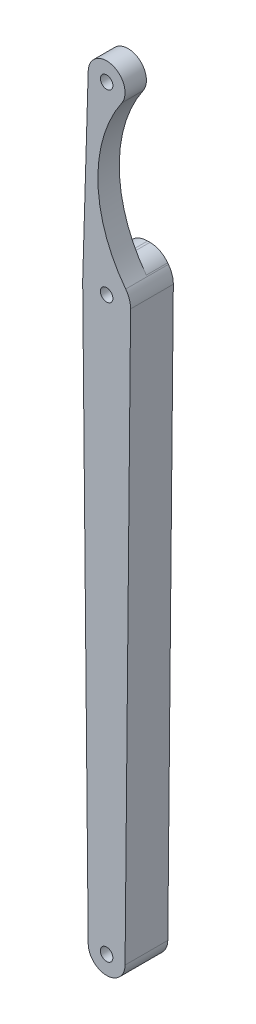
ISO-10303-21;
HEADER;
FILE_DESCRIPTION(('STEP AP214'),'2;1');
FILE_NAME('part.step','',(''),(''),'','','');
FILE_SCHEMA(('AUTOMOTIVE_DESIGN { 1 0 10303 214 1 1 1 1 }'));
ENDSEC;
DATA;
#1=APPLICATION_CONTEXT('core data for automotive mechanical design processes');
#2=APPLICATION_PROTOCOL_DEFINITION('international standard','automotive_design',2000,#1);
#3=PRODUCT_CONTEXT('',#1,'mechanical');
#4=PRODUCT('Part','Part','',(#3));
#5=PRODUCT_RELATED_PRODUCT_CATEGORY('part','',(#4));
#6=PRODUCT_DEFINITION_FORMATION('','',#4);
#7=PRODUCT_DEFINITION_CONTEXT('part definition',#1,'design');
#8=PRODUCT_DEFINITION('design','',#6,#7);
#9=PRODUCT_DEFINITION_SHAPE('','',#8);
#10=(LENGTH_UNIT() NAMED_UNIT(*) SI_UNIT(.MILLI.,.METRE.));
#11=(NAMED_UNIT(*) PLANE_ANGLE_UNIT() SI_UNIT($,.RADIAN.));
#12=(NAMED_UNIT(*) SI_UNIT($,.STERADIAN.) SOLID_ANGLE_UNIT());
#13=UNCERTAINTY_MEASURE_WITH_UNIT(LENGTH_MEASURE(1.E-05),#10,'distance_accuracy_value','');
#14=(GEOMETRIC_REPRESENTATION_CONTEXT(3) GLOBAL_UNCERTAINTY_ASSIGNED_CONTEXT((#13)) GLOBAL_UNIT_ASSIGNED_CONTEXT((#10,
#11,#12)) REPRESENTATION_CONTEXT('',''));
#15=CARTESIAN_POINT('',(0.,0.,0.));
#16=DIRECTION('',(0.,0.,1.));
#17=DIRECTION('',(1.,0.,0.));
#18=AXIS2_PLACEMENT_3D('',#15,#16,#17);
#19=CARTESIAN_POINT('',(-174.662698807646,24.,5.8));
#20=DIRECTION('',(0.,0.,1.));
#21=DIRECTION('',(1.,0.,0.));
#22=AXIS2_PLACEMENT_3D('',#19,#20,#21);
#23=PLANE('',#22);
#24=CARTESIAN_POINT('',(-174.662698807646,-131.,5.8));
#25=DIRECTION('',(0.,0.,1.));
#26=DIRECTION('',(1.,0.,0.));
#27=AXIS2_PLACEMENT_3D('',#24,#25,#26);
#28=CIRCLE('',#27,1.70000000000001);
#29=CARTESIAN_POINT('',(-172.962698807646,-131.,5.8));
#30=VERTEX_POINT('',#29);
#31=EDGE_CURVE('E239',#30,#30,#28,.T.);
#32=ORIENTED_EDGE('',*,*,#31,.F.);
#33=EDGE_LOOP('',(#32));
#34=FACE_BOUND('',#33,.T.);
#35=CARTESIAN_POINT('',(-174.662698807646,24.,5.8));
#36=DIRECTION('',(0.,0.,1.));
#37=DIRECTION('',(1.,0.,0.));
#38=AXIS2_PLACEMENT_3D('',#35,#36,#37);
#39=CIRCLE('',#38,6.49999999999999);
#40=CARTESIAN_POINT('',(-181.159773149225,24.195,5.8));
#41=VERTEX_POINT('',#40);
#42=CARTESIAN_POINT('',(-181.162394430072,23.9370967741936,5.8));
#43=VERTEX_POINT('',#42);
#44=EDGE_CURVE('E208',#41,#43,#39,.T.);
#45=ORIENTED_EDGE('',*,*,#44,.T.);
#46=DIRECTION('',(0.00967741935483877,-0.999953172680916,0.));
#47=VECTOR('',#46,1.);
#48=CARTESIAN_POINT('',(-181.162394430072,23.9370967741936,5.8));
#49=LINE('',#48,#47);
#50=CARTESIAN_POINT('',(-179.662464671051,-131.048387096774,5.8));
#51=VERTEX_POINT('',#50);
#52=EDGE_CURVE('E232',#43,#51,#49,.T.);
#53=ORIENTED_EDGE('',*,*,#52,.T.);
#54=CARTESIAN_POINT('',(-174.662698807646,-131.,5.8));
#55=DIRECTION('',(0.,0.,1.));
#56=DIRECTION('',(1.,0.,0.));
#57=AXIS2_PLACEMENT_3D('',#54,#55,#56);
#58=CIRCLE('',#57,5.00000000000001);
#59=CARTESIAN_POINT('',(-169.662932944241,-131.048387096774,5.8));
#60=VERTEX_POINT('',#59);
#61=EDGE_CURVE('E230',#51,#60,#58,.T.);
#62=ORIENTED_EDGE('',*,*,#61,.T.);
#63=DIRECTION('',(0.00967741935483877,0.999953172680916,0.));
#64=VECTOR('',#63,1.);
#65=CARTESIAN_POINT('',(-169.662932944241,-131.048387096774,5.8));
#66=LINE('',#65,#64);
#67=CARTESIAN_POINT('',(-168.16300318522,23.9370967741936,5.8));
#68=VERTEX_POINT('',#67);
#69=EDGE_CURVE('E228',#60,#68,#66,.T.);
#70=ORIENTED_EDGE('',*,*,#69,.T.);
#71=CARTESIAN_POINT('',(-174.662698807646,24.,5.8));
#72=DIRECTION('',(0.,0.,1.));
#73=DIRECTION('',(1.,0.,0.));
#74=AXIS2_PLACEMENT_3D('',#71,#72,#73);
#75=CIRCLE('',#74,6.50000000000002);
#76=CARTESIAN_POINT('',(-169.493465210308,27.9406882668078,5.8));
#77=VERTEX_POINT('',#76);
#78=EDGE_CURVE('E226',#68,#77,#75,.T.);
#79=ORIENTED_EDGE('',*,*,#78,.T.);
#80=CARTESIAN_POINT('',(-140.192523240276,50.277825107981,5.8));
#81=DIRECTION('',(0.,0.,-1.));
#82=DIRECTION('',(-1.,0.,0.));
#83=AXIS2_PLACEMENT_3D('',#80,#81,#82);
#84=CIRCLE('',#83,36.844170266034);
#85=CARTESIAN_POINT('',(-170.543824499921,71.1654145916624,5.8));
#86=VERTEX_POINT('',#85);
#87=EDGE_CURVE('E224',#77,#86,#84,.T.);
#88=ORIENTED_EDGE('',*,*,#87,.T.);
#89=CARTESIAN_POINT('',(-174.662698807646,74.,5.8));
#90=DIRECTION('',(0.,0.,1.));
#91=DIRECTION('',(1.,0.,0.));
#92=AXIS2_PLACEMENT_3D('',#89,#90,#91);
#93=CIRCLE('',#92,4.99999999999997);
#94=CARTESIAN_POINT('',(-179.660448301168,74.15,5.8));
#95=VERTEX_POINT('',#94);
#96=EDGE_CURVE('E222',#86,#95,#93,.T.);
#97=ORIENTED_EDGE('',*,*,#96,.T.);
#98=DIRECTION('',(-0.0300000000000006,-0.999549898704412,0.));
#99=VECTOR('',#98,1.);
#100=CARTESIAN_POINT('',(-181.159773149225,24.195,5.8));
#101=LINE('',#100,#99);
#102=EDGE_CURVE('E144',#95,#41,#101,.T.);
#103=ORIENTED_EDGE('',*,*,#102,.T.);
#104=EDGE_LOOP('',(#45,#53,#62,#70,#79,#88,#97,#103));
#105=FACE_BOUND('',#104,.T.);
#106=CARTESIAN_POINT('',(-174.662698807646,24.,5.8));
#107=DIRECTION('',(0.,0.,1.));
#108=DIRECTION('',(1.,0.,0.));
#109=AXIS2_PLACEMENT_3D('',#106,#107,#108);
#110=CIRCLE('',#109,1.70000000000001);
#111=CARTESIAN_POINT('',(-172.962698807646,24.,5.8));
#112=VERTEX_POINT('',#111);
#113=EDGE_CURVE('E220',#112,#112,#110,.T.);
#114=ORIENTED_EDGE('',*,*,#113,.F.);
#115=EDGE_LOOP('',(#114));
#116=FACE_BOUND('',#115,.T.);
#117=CARTESIAN_POINT('',(-174.662698807646,74.,5.8));
#118=DIRECTION('',(0.,0.,1.));
#119=DIRECTION('',(1.,0.,0.));
#120=AXIS2_PLACEMENT_3D('',#117,#118,#119);
#121=CIRCLE('',#120,1.70000000000001);
#122=CARTESIAN_POINT('',(-172.962698807646,74.,5.8));
#123=VERTEX_POINT('',#122);
#124=EDGE_CURVE('E245',#123,#123,#121,.T.);
#125=ORIENTED_EDGE('',*,*,#124,.F.);
#126=EDGE_LOOP('',(#125));
#127=FACE_BOUND('',#126,.T.);
#128=ADVANCED_FACE('F36',(#34,#105,#116,#127),#23,.T.);
#129=CARTESIAN_POINT('',(-174.662698807646,24.,-5.8));
#130=DIRECTION('',(0.,0.,1.));
#131=DIRECTION('',(1.,0.,0.));
#132=AXIS2_PLACEMENT_3D('',#129,#130,#131);
#133=PLANE('',#132);
#134=CARTESIAN_POINT('',(-174.662698807646,-131.,-5.8));
#135=DIRECTION('',(0.,0.,1.));
#136=DIRECTION('',(1.,0.,0.));
#137=AXIS2_PLACEMENT_3D('',#134,#135,#136);
#138=CIRCLE('',#137,1.70000000000001);
#139=CARTESIAN_POINT('',(-172.962698807646,-131.,-5.8));
#140=VERTEX_POINT('',#139);
#141=EDGE_CURVE('E242',#140,#140,#138,.T.);
#142=ORIENTED_EDGE('',*,*,#141,.T.);
#143=EDGE_LOOP('',(#142));
#144=FACE_BOUND('',#143,.T.);
#145=DIRECTION('',(1.,0.,0.));
#146=VECTOR('',#145,1.);
#147=CARTESIAN_POINT('',(-279.6,30.6124512493652,-5.8));
#148=LINE('',#147,#146);
#149=CARTESIAN_POINT('',(-175.144542148477,30.6124512493652,-5.8));
#150=VERTEX_POINT('',#149);
#151=CARTESIAN_POINT('',(-174.498667157691,30.6124512493652,-5.8));
#152=VERTEX_POINT('',#151);
#153=EDGE_CURVE('E170',#150,#152,#148,.T.);
#154=ORIENTED_EDGE('',*,*,#153,.T.);
#155=CARTESIAN_POINT('',(-174.498667157691,24.6124512493652,-5.8));
#156=DIRECTION('',(0.,0.,1.));
#157=DIRECTION('',(1.,0.,0.));
#158=AXIS2_PLACEMENT_3D('',#155,#156,#157);
#159=CIRCLE('',#158,6.);
#160=CARTESIAN_POINT('',(-169.694352773111,28.2066915437974,-5.8));
#161=VERTEX_POINT('',#160);
#162=EDGE_CURVE('E178',#152,#161,#159,.F.);
#163=ORIENTED_EDGE('',*,*,#162,.T.);
#164=CARTESIAN_POINT('',(-140.192523240276,50.277825107981,-5.8));
#165=DIRECTION('',(0.,0.,-1.));
#166=DIRECTION('',(-1.,0.,0.));
#167=AXIS2_PLACEMENT_3D('',#164,#165,#166);
#168=CIRCLE('',#167,36.844170266034);
#169=CARTESIAN_POINT('',(-169.493465210308,27.9406882668078,-5.8));
#170=VERTEX_POINT('',#169);
#171=EDGE_CURVE('E200',#170,#161,#168,.T.);
#172=ORIENTED_EDGE('',*,*,#171,.F.);
#173=CARTESIAN_POINT('',(-174.662698807646,24.,-5.8));
#174=DIRECTION('',(0.,0.,1.));
#175=DIRECTION('',(1.,0.,0.));
#176=AXIS2_PLACEMENT_3D('',#173,#174,#175);
#177=CIRCLE('',#176,6.50000000000002);
#178=CARTESIAN_POINT('',(-168.16300318522,23.9370967741936,-5.8));
#179=VERTEX_POINT('',#178);
#180=EDGE_CURVE('E206',#179,#170,#177,.T.);
#181=ORIENTED_EDGE('',*,*,#180,.F.);
#182=DIRECTION('',(0.00967741935483877,0.999953172680916,0.));
#183=VECTOR('',#182,1.);
#184=CARTESIAN_POINT('',(-169.662932944241,-131.048387096774,-5.8));
#185=LINE('',#184,#183);
#186=CARTESIAN_POINT('',(-169.662932944241,-131.048387096774,-5.8));
#187=VERTEX_POINT('',#186);
#188=EDGE_CURVE('E209',#187,#179,#185,.T.);
#189=ORIENTED_EDGE('',*,*,#188,.F.);
#190=CARTESIAN_POINT('',(-174.662698807646,-131.,-5.8));
#191=DIRECTION('',(0.,0.,1.));
#192=DIRECTION('',(1.,0.,0.));
#193=AXIS2_PLACEMENT_3D('',#190,#191,#192);
#194=CIRCLE('',#193,5.00000000000001);
#195=CARTESIAN_POINT('',(-179.662464671051,-131.048387096774,-5.8));
#196=VERTEX_POINT('',#195);
#197=EDGE_CURVE('E213',#196,#187,#194,.T.);
#198=ORIENTED_EDGE('',*,*,#197,.F.);
#199=DIRECTION('',(0.00967741935483877,-0.999953172680916,0.));
#200=VECTOR('',#199,1.);
#201=CARTESIAN_POINT('',(-181.162394430072,23.9370967741936,-5.8));
#202=LINE('',#201,#200);
#203=CARTESIAN_POINT('',(-181.162394430072,23.9370967741936,-5.8));
#204=VERTEX_POINT('',#203);
#205=EDGE_CURVE('E215',#204,#196,#202,.T.);
#206=ORIENTED_EDGE('',*,*,#205,.F.);
#207=CARTESIAN_POINT('',(-174.662698807646,24.,-5.8));
#208=DIRECTION('',(0.,0.,1.));
#209=DIRECTION('',(1.,0.,0.));
#210=AXIS2_PLACEMENT_3D('',#207,#208,#209);
#211=CIRCLE('',#210,6.49999999999999);
#212=CARTESIAN_POINT('',(-181.159773149225,24.195,-5.8));
#213=VERTEX_POINT('',#212);
#214=EDGE_CURVE('E217',#213,#204,#211,.T.);
#215=ORIENTED_EDGE('',*,*,#214,.F.);
#216=DIRECTION('',(-0.0300000000000006,-0.999549898704412,0.));
#217=VECTOR('',#216,1.);
#218=CARTESIAN_POINT('',(-181.159773149225,24.195,-5.8));
#219=LINE('',#218,#217);
#220=CARTESIAN_POINT('',(-181.141841540703,24.7924512493652,-5.8));
#221=VERTEX_POINT('',#220);
#222=EDGE_CURVE('E205',#221,#213,#219,.T.);
#223=ORIENTED_EDGE('',*,*,#222,.F.);
#224=CARTESIAN_POINT('',(-175.144542148477,24.6124512493652,-5.8));
#225=DIRECTION('',(0.,0.,1.));
#226=DIRECTION('',(1.,0.,0.));
#227=AXIS2_PLACEMENT_3D('',#224,#225,#226);
#228=CIRCLE('',#227,6.);
#229=EDGE_CURVE('E58',#221,#150,#228,.F.);
#230=ORIENTED_EDGE('',*,*,#229,.T.);
#231=EDGE_LOOP('',(#154,#163,#172,#181,#189,#198,#206,#215,#223,#230));
#232=FACE_BOUND('',#231,.T.);
#233=CARTESIAN_POINT('',(-174.662698807646,24.,-5.8));
#234=DIRECTION('',(0.,0.,1.));
#235=DIRECTION('',(1.,0.,0.));
#236=AXIS2_PLACEMENT_3D('',#233,#234,#235);
#237=CIRCLE('',#236,1.70000000000001);
#238=CARTESIAN_POINT('',(-172.962698807646,24.,-5.8));
#239=VERTEX_POINT('',#238);
#240=EDGE_CURVE('E236',#239,#239,#237,.T.);
#241=ORIENTED_EDGE('',*,*,#240,.T.);
#242=EDGE_LOOP('',(#241));
#243=FACE_BOUND('',#242,.T.);
#244=ADVANCED_FACE('F197',(#144,#232,#243),#133,.F.);
#245=CARTESIAN_POINT('',(-174.662698807646,24.,5.8));
#246=DIRECTION('',(0.,0.,-1.));
#247=DIRECTION('',(-1.,0.,0.));
#248=AXIS2_PLACEMENT_3D('',#245,#246,#247);
#249=CYLINDRICAL_SURFACE('',#248,6.49999999999999);
#250=ORIENTED_EDGE('',*,*,#214,.T.);
#251=DIRECTION('',(0.,0.,-1.));
#252=VECTOR('',#251,1.);
#253=CARTESIAN_POINT('',(-181.162394430072,23.9370967741936,5.8));
#254=LINE('',#253,#252);
#255=EDGE_CURVE('E164',#43,#204,#254,.T.);
#256=ORIENTED_EDGE('',*,*,#255,.F.);
#257=ORIENTED_EDGE('',*,*,#44,.F.);
#258=DIRECTION('',(0.,0.,-1.));
#259=VECTOR('',#258,1.);
#260=CARTESIAN_POINT('',(-181.159773149225,24.195,5.8));
#261=LINE('',#260,#259);
#262=EDGE_CURVE('E145',#41,#213,#261,.T.);
#263=ORIENTED_EDGE('',*,*,#262,.T.);
#264=EDGE_LOOP('',(#250,#256,#257,#263));
#265=FACE_BOUND('',#264,.T.);
#266=ADVANCED_FACE('F273',(#265),#249,.T.);
#267=CARTESIAN_POINT('',(-181.162394430072,23.9370967741936,5.8));
#268=DIRECTION('',(0.999953172680916,0.00967741935483877,0.));
#269=DIRECTION('',(-0.00967741935483877,0.999953172680917,0.));
#270=AXIS2_PLACEMENT_3D('',#267,#268,#269);
#271=PLANE('',#270);
#272=ORIENTED_EDGE('',*,*,#205,.T.);
#273=DIRECTION('',(0.,0.,-1.));
#274=VECTOR('',#273,1.);
#275=CARTESIAN_POINT('',(-179.662464671051,-131.048387096774,5.8));
#276=LINE('',#275,#274);
#277=EDGE_CURVE('E161',#51,#196,#276,.T.);
#278=ORIENTED_EDGE('',*,*,#277,.F.);
#279=ORIENTED_EDGE('',*,*,#52,.F.);
#280=ORIENTED_EDGE('',*,*,#255,.T.);
#281=EDGE_LOOP('',(#272,#278,#279,#280));
#282=FACE_BOUND('',#281,.T.);
#283=ADVANCED_FACE('F268',(#282),#271,.F.);
#284=CARTESIAN_POINT('',(-174.662698807646,-131.,5.8));
#285=DIRECTION('',(0.,0.,-1.));
#286=DIRECTION('',(-1.,0.,0.));
#287=AXIS2_PLACEMENT_3D('',#284,#285,#286);
#288=CYLINDRICAL_SURFACE('',#287,5.00000000000001);
#289=ORIENTED_EDGE('',*,*,#197,.T.);
#290=DIRECTION('',(0.,0.,-1.));
#291=VECTOR('',#290,1.);
#292=CARTESIAN_POINT('',(-169.662932944241,-131.048387096774,5.8));
#293=LINE('',#292,#291);
#294=EDGE_CURVE('E158',#60,#187,#293,.T.);
#295=ORIENTED_EDGE('',*,*,#294,.F.);
#296=ORIENTED_EDGE('',*,*,#61,.F.);
#297=ORIENTED_EDGE('',*,*,#277,.T.);
#298=EDGE_LOOP('',(#289,#295,#296,#297));
#299=FACE_BOUND('',#298,.T.);
#300=ADVANCED_FACE('F265',(#299),#288,.T.);
#301=CARTESIAN_POINT('',(-169.662932944241,-131.048387096774,5.8));
#302=DIRECTION('',(-0.999953172680916,0.00967741935483877,0.));
#303=DIRECTION('',(-0.00967741935483877,-0.999953172680917,0.));
#304=AXIS2_PLACEMENT_3D('',#301,#302,#303);
#305=PLANE('',#304);
#306=ORIENTED_EDGE('',*,*,#188,.T.);
#307=DIRECTION('',(0.,0.,-1.));
#308=VECTOR('',#307,1.);
#309=CARTESIAN_POINT('',(-168.16300318522,23.9370967741936,5.8));
#310=LINE('',#309,#308);
#311=EDGE_CURVE('E155',#68,#179,#310,.T.);
#312=ORIENTED_EDGE('',*,*,#311,.F.);
#313=ORIENTED_EDGE('',*,*,#69,.F.);
#314=ORIENTED_EDGE('',*,*,#294,.T.);
#315=EDGE_LOOP('',(#306,#312,#313,#314));
#316=FACE_BOUND('',#315,.T.);
#317=ADVANCED_FACE('F261',(#316),#305,.F.);
#318=CARTESIAN_POINT('',(-174.662698807646,24.,5.8));
#319=DIRECTION('',(0.,0.,-1.));
#320=DIRECTION('',(-1.,0.,0.));
#321=AXIS2_PLACEMENT_3D('',#318,#319,#320);
#322=CYLINDRICAL_SURFACE('',#321,6.50000000000002);
#323=ORIENTED_EDGE('',*,*,#180,.T.);
#324=DIRECTION('',(0.,0.,-1.));
#325=VECTOR('',#324,1.);
#326=CARTESIAN_POINT('',(-169.493465210308,27.9406882668078,5.8));
#327=LINE('',#326,#325);
#328=EDGE_CURVE('E147',#77,#170,#327,.T.);
#329=ORIENTED_EDGE('',*,*,#328,.F.);
#330=ORIENTED_EDGE('',*,*,#78,.F.);
#331=ORIENTED_EDGE('',*,*,#311,.T.);
#332=EDGE_LOOP('',(#323,#329,#330,#331));
#333=FACE_BOUND('',#332,.T.);
#334=ADVANCED_FACE('F257',(#333),#322,.T.);
#335=CARTESIAN_POINT('',(-140.192523240276,50.277825107981,5.8));
#336=DIRECTION('',(0.,0.,-1.));
#337=DIRECTION('',(-1.,0.,0.));
#338=AXIS2_PLACEMENT_3D('',#335,#336,#337);
#339=CYLINDRICAL_SURFACE('',#338,36.844170266034);
#340=ORIENTED_EDGE('',*,*,#171,.T.);
#341=DIRECTION('',(0.,0.,-1.));
#342=VECTOR('',#341,1.);
#343=CARTESIAN_POINT('',(-169.694352773111,28.2066915437974,5.8));
#344=LINE('',#343,#342);
#345=CARTESIAN_POINT('',(-169.694352773111,28.2066915437974,0.));
#346=VERTEX_POINT('',#345);
#347=EDGE_CURVE('E167',#161,#346,#344,.F.);
#348=ORIENTED_EDGE('',*,*,#347,.T.);
#349=CARTESIAN_POINT('',(-140.192523240276,50.277825107981,0.));
#350=DIRECTION('',(0.,0.,1.));
#351=DIRECTION('',(0.,-1.,0.));
#352=AXIS2_PLACEMENT_3D('',#349,#350,#351);
#353=CIRCLE('',#352,36.844170266034);
#354=CARTESIAN_POINT('',(-170.543824499921,71.1654145916624,0.));
#355=VERTEX_POINT('',#354);
#356=EDGE_CURVE('E135',#346,#355,#353,.F.);
#357=ORIENTED_EDGE('',*,*,#356,.T.);
#358=DIRECTION('',(0.,0.,-1.));
#359=VECTOR('',#358,1.);
#360=CARTESIAN_POINT('',(-170.543824499921,71.1654145916624,5.8));
#361=LINE('',#360,#359);
#362=EDGE_CURVE('E132',#86,#355,#361,.T.);
#363=ORIENTED_EDGE('',*,*,#362,.F.);
#364=ORIENTED_EDGE('',*,*,#87,.F.);
#365=ORIENTED_EDGE('',*,*,#328,.T.);
#366=EDGE_LOOP('',(#340,#348,#357,#363,#364,#365));
#367=FACE_BOUND('',#366,.T.);
#368=ADVANCED_FACE('F202',(#367),#339,.F.);
#369=CARTESIAN_POINT('',(-174.662698807646,74.,5.8));
#370=DIRECTION('',(0.,0.,-1.));
#371=DIRECTION('',(-1.,0.,0.));
#372=AXIS2_PLACEMENT_3D('',#369,#370,#371);
#373=CYLINDRICAL_SURFACE('',#372,4.99999999999997);
#374=CARTESIAN_POINT('',(-174.662698807646,74.,0.));
#375=DIRECTION('',(0.,0.,1.));
#376=DIRECTION('',(0.,-1.,0.));
#377=AXIS2_PLACEMENT_3D('',#374,#375,#376);
#378=CIRCLE('',#377,4.99999999999997);
#379=CARTESIAN_POINT('',(-179.660448301168,74.15,0.));
#380=VERTEX_POINT('',#379);
#381=EDGE_CURVE('E126',#355,#380,#378,.T.);
#382=ORIENTED_EDGE('',*,*,#381,.T.);
#383=DIRECTION('',(0.,0.,-1.));
#384=VECTOR('',#383,1.);
#385=CARTESIAN_POINT('',(-179.660448301168,74.15,5.8));
#386=LINE('',#385,#384);
#387=EDGE_CURVE('E129',#95,#380,#386,.T.);
#388=ORIENTED_EDGE('',*,*,#387,.F.);
#389=ORIENTED_EDGE('',*,*,#96,.F.);
#390=ORIENTED_EDGE('',*,*,#362,.T.);
#391=EDGE_LOOP('',(#382,#388,#389,#390));
#392=FACE_BOUND('',#391,.T.);
#393=ADVANCED_FACE('F127',(#392),#373,.T.);
#394=CARTESIAN_POINT('',(-181.159773149225,24.195,5.8));
#395=DIRECTION('',(0.999549898704412,-0.0300000000000006,0.));
#396=DIRECTION('',(0.0300000000000006,0.999549898704412,0.));
#397=AXIS2_PLACEMENT_3D('',#394,#395,#396);
#398=PLANE('',#397);
#399=DIRECTION('',(-0.0300000000000006,-0.999549898704412,0.));
#400=VECTOR('',#399,1.);
#401=CARTESIAN_POINT('',(-181.159773149225,24.195,0.));
#402=LINE('',#401,#400);
#403=CARTESIAN_POINT('',(-181.141841540703,24.7924512493652,0.));
#404=VERTEX_POINT('',#403);
#405=EDGE_CURVE('E51',#380,#404,#402,.T.);
#406=ORIENTED_EDGE('',*,*,#405,.T.);
#407=DIRECTION('',(0.,0.,-1.));
#408=VECTOR('',#407,1.);
#409=CARTESIAN_POINT('',(-181.141841540703,24.7924512493652,5.8));
#410=LINE('',#409,#408);
#411=EDGE_CURVE('E180',#404,#221,#410,.T.);
#412=ORIENTED_EDGE('',*,*,#411,.T.);
#413=ORIENTED_EDGE('',*,*,#222,.T.);
#414=ORIENTED_EDGE('',*,*,#262,.F.);
#415=ORIENTED_EDGE('',*,*,#102,.F.);
#416=ORIENTED_EDGE('',*,*,#387,.T.);
#417=EDGE_LOOP('',(#406,#412,#413,#414,#415,#416));
#418=FACE_BOUND('',#417,.T.);
#419=ADVANCED_FACE('F142',(#418),#398,.F.);
#420=CARTESIAN_POINT('',(-174.662698807646,24.,5.8));
#421=DIRECTION('',(0.,0.,-1.));
#422=DIRECTION('',(-1.,0.,0.));
#423=AXIS2_PLACEMENT_3D('',#420,#421,#422);
#424=CYLINDRICAL_SURFACE('',#423,1.70000000000001);
#425=ORIENTED_EDGE('',*,*,#113,.T.);
#426=EDGE_LOOP('',(#425));
#427=FACE_BOUND('',#426,.T.);
#428=ORIENTED_EDGE('',*,*,#240,.F.);
#429=EDGE_LOOP('',(#428));
#430=FACE_BOUND('',#429,.T.);
#431=ADVANCED_FACE('F289',(#427,#430),#424,.F.);
#432=CARTESIAN_POINT('',(-174.662698807646,-131.,5.8));
#433=DIRECTION('',(0.,0.,-1.));
#434=DIRECTION('',(-1.,0.,0.));
#435=AXIS2_PLACEMENT_3D('',#432,#433,#434);
#436=CYLINDRICAL_SURFACE('',#435,1.70000000000001);
#437=ORIENTED_EDGE('',*,*,#31,.T.);
#438=EDGE_LOOP('',(#437));
#439=FACE_BOUND('',#438,.T.);
#440=ORIENTED_EDGE('',*,*,#141,.F.);
#441=EDGE_LOOP('',(#440));
#442=FACE_BOUND('',#441,.T.);
#443=ADVANCED_FACE('F349',(#439,#442),#436,.F.);
#444=CARTESIAN_POINT('',(-174.662698807646,74.,5.8));
#445=DIRECTION('',(0.,0.,-1.));
#446=DIRECTION('',(-1.,0.,0.));
#447=AXIS2_PLACEMENT_3D('',#444,#445,#446);
#448=CYLINDRICAL_SURFACE('',#447,1.70000000000001);
#449=CARTESIAN_POINT('',(-174.662698807646,74.,0.));
#450=DIRECTION('',(0.,0.,1.));
#451=DIRECTION('',(0.,-1.,0.));
#452=AXIS2_PLACEMENT_3D('',#449,#450,#451);
#453=CIRCLE('',#452,1.70000000000001);
#454=CARTESIAN_POINT('',(-174.662698807646,72.3,0.));
#455=VERTEX_POINT('',#454);
#456=EDGE_CURVE('E140',#455,#455,#453,.T.);
#457=ORIENTED_EDGE('',*,*,#456,.F.);
#458=EDGE_LOOP('',(#457));
#459=FACE_BOUND('',#458,.T.);
#460=ORIENTED_EDGE('',*,*,#124,.T.);
#461=EDGE_LOOP('',(#460));
#462=FACE_BOUND('',#461,.T.);
#463=ADVANCED_FACE('F355',(#459,#462),#448,.F.);
#464=CARTESIAN_POINT('',(-279.6,30.6124512493652,-5.8));
#465=DIRECTION('',(0.,-1.,0.));
#466=DIRECTION('',(0.,0.,-1.));
#467=AXIS2_PLACEMENT_3D('',#464,#465,#466);
#468=PLANE('',#467);
#469=DIRECTION('',(1.,0.,0.));
#470=VECTOR('',#469,1.);
#471=CARTESIAN_POINT('',(-279.6,30.6124512493652,0.));
#472=LINE('',#471,#470);
#473=CARTESIAN_POINT('',(-175.144542148477,30.6124512493652,0.));
#474=VERTEX_POINT('',#473);
#475=CARTESIAN_POINT('',(-174.498667157691,30.6124512493652,0.));
#476=VERTEX_POINT('',#475);
#477=EDGE_CURVE('E183',#474,#476,#472,.T.);
#478=ORIENTED_EDGE('',*,*,#477,.T.);
#479=DIRECTION('',(0.,0.,-1.));
#480=VECTOR('',#479,1.);
#481=CARTESIAN_POINT('',(-174.498667157691,30.6124512493652,-5.8));
#482=LINE('',#481,#480);
#483=EDGE_CURVE('E175',#476,#152,#482,.T.);
#484=ORIENTED_EDGE('',*,*,#483,.T.);
#485=ORIENTED_EDGE('',*,*,#153,.F.);
#486=DIRECTION('',(0.,0.,-1.));
#487=VECTOR('',#486,1.);
#488=CARTESIAN_POINT('',(-175.144542148477,30.6124512493652,-5.8));
#489=LINE('',#488,#487);
#490=EDGE_CURVE('E173',#150,#474,#489,.F.);
#491=ORIENTED_EDGE('',*,*,#490,.T.);
#492=EDGE_LOOP('',(#478,#484,#485,#491));
#493=FACE_BOUND('',#492,.T.);
#494=ADVANCED_FACE('F188',(#493),#468,.F.);
#495=CARTESIAN_POINT('',(-279.6,79.,0.));
#496=DIRECTION('',(0.,0.,1.));
#497=DIRECTION('',(0.,-1.,0.));
#498=AXIS2_PLACEMENT_3D('',#495,#496,#497);
#499=PLANE('',#498);
#500=ORIENTED_EDGE('',*,*,#456,.T.);
#501=EDGE_LOOP('',(#500));
#502=FACE_BOUND('',#501,.T.);
#503=ORIENTED_EDGE('',*,*,#477,.F.);
#504=CARTESIAN_POINT('',(-175.144542148477,24.6124512493652,0.));
#505=DIRECTION('',(0.,0.,1.));
#506=DIRECTION('',(0.,-1.,0.));
#507=AXIS2_PLACEMENT_3D('',#504,#505,#506);
#508=CIRCLE('',#507,6.);
#509=EDGE_CURVE('E11',#474,#404,#508,.T.);
#510=ORIENTED_EDGE('',*,*,#509,.T.);
#511=ORIENTED_EDGE('',*,*,#405,.F.);
#512=ORIENTED_EDGE('',*,*,#381,.F.);
#513=ORIENTED_EDGE('',*,*,#356,.F.);
#514=CARTESIAN_POINT('',(-174.498667157691,24.6124512493652,0.));
#515=DIRECTION('',(0.,0.,1.));
#516=DIRECTION('',(0.,-1.,0.));
#517=AXIS2_PLACEMENT_3D('',#514,#515,#516);
#518=CIRCLE('',#517,6.);
#519=EDGE_CURVE('E44',#346,#476,#518,.T.);
#520=ORIENTED_EDGE('',*,*,#519,.T.);
#521=EDGE_LOOP('',(#503,#510,#511,#512,#513,#520));
#522=FACE_BOUND('',#521,.T.);
#523=ADVANCED_FACE('F138',(#502,#522),#499,.F.);
#524=CARTESIAN_POINT('',(-174.498667157691,24.6124512493652,5.8));
#525=DIRECTION('',(0.,0.,-1.));
#526=DIRECTION('',(-1.,0.,0.));
#527=AXIS2_PLACEMENT_3D('',#524,#525,#526);
#528=CYLINDRICAL_SURFACE('',#527,6.);
#529=ORIENTED_EDGE('',*,*,#162,.F.);
#530=ORIENTED_EDGE('',*,*,#483,.F.);
#531=ORIENTED_EDGE('',*,*,#519,.F.);
#532=ORIENTED_EDGE('',*,*,#347,.F.);
#533=EDGE_LOOP('',(#529,#530,#531,#532));
#534=FACE_BOUND('',#533,.T.);
#535=ADVANCED_FACE('F193',(#534),#528,.T.);
#536=CARTESIAN_POINT('',(-175.144542148477,24.6124512493652,5.8));
#537=DIRECTION('',(0.,0.,-1.));
#538=DIRECTION('',(-1.,0.,0.));
#539=AXIS2_PLACEMENT_3D('',#536,#537,#538);
#540=CYLINDRICAL_SURFACE('',#539,6.);
#541=ORIENTED_EDGE('',*,*,#509,.F.);
#542=ORIENTED_EDGE('',*,*,#490,.F.);
#543=ORIENTED_EDGE('',*,*,#229,.F.);
#544=ORIENTED_EDGE('',*,*,#411,.F.);
#545=EDGE_LOOP('',(#541,#542,#543,#544));
#546=FACE_BOUND('',#545,.T.);
#547=ADVANCED_FACE('F38',(#546),#540,.T.);
#548=CLOSED_SHELL('',(#128,#244,#266,#283,#300,#317,#334,#368,#393,#419,#431,#443,#463,#494,
#523,#535,#547));
#549=MANIFOLD_SOLID_BREP('B2',#548);
#550=ADVANCED_BREP_SHAPE_REPRESENTATION('',(#18,#549),#14);
#551=SHAPE_DEFINITION_REPRESENTATION(#9,#550);
ENDSEC;
END-ISO-10303-21;
